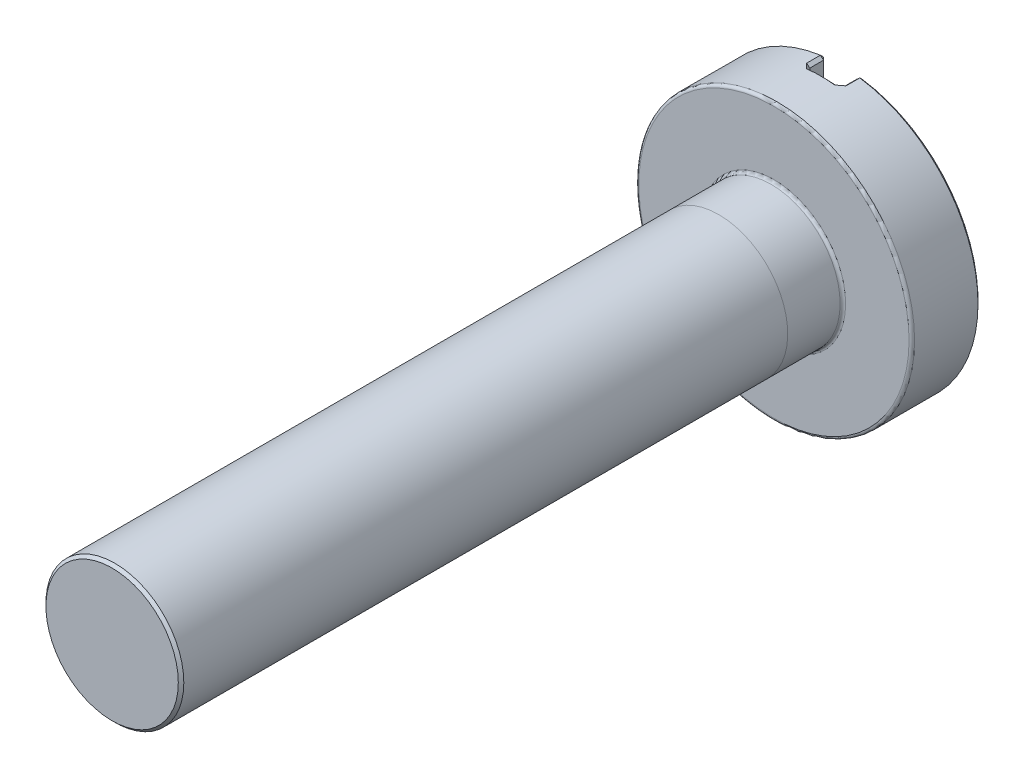
ISO-10303-21;
HEADER;
FILE_DESCRIPTION(('STEP AP214'),'2;1');
FILE_NAME('part.step','',(''),(''),'','','');
FILE_SCHEMA(('AUTOMOTIVE_DESIGN { 1 0 10303 214 1 1 1 1 }'));
ENDSEC;
DATA;
#1=APPLICATION_CONTEXT('core data for automotive mechanical design processes');
#2=APPLICATION_PROTOCOL_DEFINITION('international standard','automotive_design',2000,#1);
#3=PRODUCT_CONTEXT('',#1,'mechanical');
#4=PRODUCT('Part','Part','',(#3));
#5=PRODUCT_RELATED_PRODUCT_CATEGORY('part','',(#4));
#6=PRODUCT_DEFINITION_FORMATION('','',#4);
#7=PRODUCT_DEFINITION_CONTEXT('part definition',#1,'design');
#8=PRODUCT_DEFINITION('design','',#6,#7);
#9=PRODUCT_DEFINITION_SHAPE('','',#8);
#10=(LENGTH_UNIT() NAMED_UNIT(*) SI_UNIT(.MILLI.,.METRE.));
#11=(NAMED_UNIT(*) PLANE_ANGLE_UNIT() SI_UNIT($,.RADIAN.));
#12=(NAMED_UNIT(*) SI_UNIT($,.STERADIAN.) SOLID_ANGLE_UNIT());
#13=UNCERTAINTY_MEASURE_WITH_UNIT(LENGTH_MEASURE(1.E-05),#10,'distance_accuracy_value','');
#14=(GEOMETRIC_REPRESENTATION_CONTEXT(3) GLOBAL_UNCERTAINTY_ASSIGNED_CONTEXT((#13)) GLOBAL_UNIT_ASSIGNED_CONTEXT((#10,
#11,#12)) REPRESENTATION_CONTEXT('',''));
#15=CARTESIAN_POINT('',(0.,0.,0.));
#16=DIRECTION('',(0.,0.,1.));
#17=DIRECTION('',(1.,0.,0.));
#18=AXIS2_PLACEMENT_3D('',#15,#16,#17);
#19=CARTESIAN_POINT('',(0.,0.,12.));
#20=DIRECTION('',(0.,0.,-1.));
#21=DIRECTION('',(-1.,0.,0.));
#22=AXIS2_PLACEMENT_3D('',#19,#20,#21);
#23=CYLINDRICAL_SURFACE('',#22,1.25);
#24=CARTESIAN_POINT('',(0.,0.,11.95));
#25=DIRECTION('',(0.,0.,1.));
#26=DIRECTION('',(1.,0.,0.));
#27=AXIS2_PLACEMENT_3D('',#24,#25,#26);
#28=CIRCLE('',#27,1.25);
#29=CARTESIAN_POINT('',(1.25,0.,11.95));
#30=VERTEX_POINT('',#29);
#31=EDGE_CURVE('E46',#30,#30,#28,.F.);
#32=ORIENTED_EDGE('',*,*,#31,.T.);
#33=EDGE_LOOP('',(#32));
#34=FACE_BOUND('',#33,.T.);
#35=CARTESIAN_POINT('',(0.,0.,1.));
#36=DIRECTION('',(0.,0.,-1.));
#37=DIRECTION('',(0.,1.,0.));
#38=AXIS2_PLACEMENT_3D('',#35,#36,#37);
#39=CIRCLE('',#38,1.25);
#40=CARTESIAN_POINT('',(0.,1.25,1.));
#41=VERTEX_POINT('',#40);
#42=EDGE_CURVE('E11',#41,#41,#39,.T.);
#43=ORIENTED_EDGE('',*,*,#42,.F.);
#44=EDGE_LOOP('',(#43));
#45=FACE_BOUND('',#44,.T.);
#46=ADVANCED_FACE('F37',(#34,#45),#23,.T.);
#47=CARTESIAN_POINT('',(0.,0.,-1.25));
#48=DIRECTION('',(0.,0.,1.));
#49=DIRECTION('',(1.,0.,0.));
#50=AXIS2_PLACEMENT_3D('',#47,#48,#49);
#51=CYLINDRICAL_SURFACE('',#50,2.5);
#52=CARTESIAN_POINT('',(0.,0.,-0.0499999999999999));
#53=DIRECTION('',(0.,0.,1.));
#54=DIRECTION('',(1.,0.,0.));
#55=AXIS2_PLACEMENT_3D('',#52,#53,#54);
#56=CIRCLE('',#55,2.5);
#57=CARTESIAN_POINT('',(2.5,0.,-0.0499999999999999));
#58=VERTEX_POINT('',#57);
#59=EDGE_CURVE('E461',#58,#58,#56,.F.);
#60=ORIENTED_EDGE('',*,*,#59,.T.);
#61=EDGE_LOOP('',(#60));
#62=FACE_BOUND('',#61,.T.);
#63=CARTESIAN_POINT('',(-0.357142857142859,2.47435829652697,-0.950000000000001));
#64=CARTESIAN_POINT('',(-0.348283128722046,2.47563702333073,-0.941134122382786));
#65=CARTESIAN_POINT('',(-0.339398611806158,2.47687086598076,-0.932286484523354));
#66=CARTESIAN_POINT('',(-0.321576086205338,2.47924782192304,-0.914632993380492));
#67=CARTESIAN_POINT('',(-0.312638077482019,2.48039093515016,-0.905827140127055));
#68=CARTESIAN_POINT('',(-0.287577804069122,2.48345759248477,-0.881282240398704));
#69=CARTESIAN_POINT('',(-0.271391793277396,2.48527929599136,-0.865595509519482));
#70=CARTESIAN_POINT('',(-0.25510204081875,2.48695053203223,-0.850000000001686));
#71=B_SPLINE_CURVE_WITH_KNOTS('',3,(#63,#64,#65,#66,#67,#68,#69,#70),.UNSPECIFIED.,.F.,.F.,(4,2,
2,4),(0.,0.0377968117810584,0.0755936506896942,0.143431941871321),.UNSPECIFIED.);
#72=CARTESIAN_POINT('',(-0.357142857142859,2.47435829652697,-0.950000000000001));
#73=VERTEX_POINT('',#72);
#74=CARTESIAN_POINT('',(-0.255102040816325,2.48695053203142,-0.849999999999999));
#75=VERTEX_POINT('',#74);
#76=EDGE_CURVE('E250',#73,#75,#71,.T.);
#77=ORIENTED_EDGE('',*,*,#76,.F.);
#78=DIRECTION('',(0.,0.,1.));
#79=VECTOR('',#78,1.);
#80=CARTESIAN_POINT('',(-0.357142857142859,2.47435829652697,-1.25));
#81=LINE('',#80,#79);
#82=CARTESIAN_POINT('',(-0.357142857142859,2.47435829652697,-1.2));
#83=VERTEX_POINT('',#82);
#84=EDGE_CURVE('E248',#73,#83,#81,.F.);
#85=ORIENTED_EDGE('',*,*,#84,.T.);
#86=CARTESIAN_POINT('',(0.,0.,-1.2));
#87=DIRECTION('',(0.,0.,1.));
#88=DIRECTION('',(1.,0.,0.));
#89=AXIS2_PLACEMENT_3D('',#86,#87,#88);
#90=CIRCLE('',#89,2.5);
#91=CARTESIAN_POINT('',(-0.357142857142859,-2.47435829652697,-1.2));
#92=VERTEX_POINT('',#91);
#93=EDGE_CURVE('E243',#83,#92,#90,.T.);
#94=ORIENTED_EDGE('',*,*,#93,.T.);
#95=DIRECTION('',(0.,0.,1.));
#96=VECTOR('',#95,1.);
#97=CARTESIAN_POINT('',(-0.357142857142859,-2.47435829652697,-1.25));
#98=LINE('',#97,#96);
#99=CARTESIAN_POINT('',(-0.357142857142859,-2.47435829652697,-0.950000000000001));
#100=VERTEX_POINT('',#99);
#101=EDGE_CURVE('E241',#92,#100,#98,.T.);
#102=ORIENTED_EDGE('',*,*,#101,.T.);
#103=CARTESIAN_POINT('',(-0.255102040816326,-2.48695053203142,-0.849999999999999));
#104=CARTESIAN_POINT('',(-0.264178191386565,-2.48601946587719,-0.858688711502498));
#105=CARTESIAN_POINT('',(-0.273221965792444,-2.48504163410855,-0.86740607020343));
#106=CARTESIAN_POINT('',(-0.291248879878858,-2.4829934567889,-0.884892451642306));
#107=CARTESIAN_POINT('',(-0.300232019629449,-2.4819231113448,-0.893661474320537));
#108=CARTESIAN_POINT('',(-0.325259245581335,-2.47880383809922,-0.918233587454575));
#109=CARTESIAN_POINT('',(-0.341240583045981,-2.47665328543806,-0.934087828582101));
#110=CARTESIAN_POINT('',(-0.357142857142859,-2.47435829652697,-0.950000000000001));
#111=B_SPLINE_CURVE_WITH_KNOTS('',3,(#103,#104,#105,#106,#107,#108,#109,#110),.UNSPECIFIED.,.F.,
.F.,(4,2,2,4),(0.,0.0377969208692553,0.0755937980612077,0.143432033029298),.UNSPECIFIED.);
#112=CARTESIAN_POINT('',(-0.255102040816326,-2.48695053203142,-0.849999999999999));
#113=VERTEX_POINT('',#112);
#114=EDGE_CURVE('E234',#113,#100,#111,.T.);
#115=ORIENTED_EDGE('',*,*,#114,.F.);
#116=CARTESIAN_POINT('',(0.,0.,-0.849999999999999));
#117=DIRECTION('',(0.,0.,-1.));
#118=DIRECTION('',(-1.,0.,0.));
#119=AXIS2_PLACEMENT_3D('',#116,#117,#118);
#120=CIRCLE('',#119,2.5);
#121=CARTESIAN_POINT('',(0.255102040816324,-2.48695053203142,-0.849999999999999));
#122=VERTEX_POINT('',#121);
#123=EDGE_CURVE('E197',#113,#122,#120,.F.);
#124=ORIENTED_EDGE('',*,*,#123,.T.);
#125=CARTESIAN_POINT('',(0.357142857142858,-2.47435829652697,-0.950000000000001));
#126=CARTESIAN_POINT('',(0.348283128722045,-2.47563702333072,-0.941134122382786));
#127=CARTESIAN_POINT('',(0.339398611806156,-2.47687086598076,-0.932286484523354));
#128=CARTESIAN_POINT('',(0.321576086205337,-2.47924782192304,-0.914632993380492));
#129=CARTESIAN_POINT('',(0.312638077482018,-2.48039093515016,-0.905827140127055));
#130=CARTESIAN_POINT('',(0.287577804069122,-2.48345759248477,-0.881282240398703));
#131=CARTESIAN_POINT('',(0.271391793277396,-2.48527929599137,-0.865595509519482));
#132=CARTESIAN_POINT('',(0.255102040818749,-2.48695053203224,-0.850000000001686));
#133=B_SPLINE_CURVE_WITH_KNOTS('',3,(#125,#126,#127,#128,#129,#130,#131,#132),.UNSPECIFIED.,.F.,
.F.,(4,2,2,4),(0.,0.0377968117810586,0.0755936506896945,0.143431941871321),.UNSPECIFIED.);
#134=CARTESIAN_POINT('',(0.357142857142858,-2.47435829652697,-0.950000000000001));
#135=VERTEX_POINT('',#134);
#136=EDGE_CURVE('E188',#135,#122,#133,.T.);
#137=ORIENTED_EDGE('',*,*,#136,.F.);
#138=DIRECTION('',(0.,0.,1.));
#139=VECTOR('',#138,1.);
#140=CARTESIAN_POINT('',(0.357142857142858,-2.47435829652697,-1.25));
#141=LINE('',#140,#139);
#142=CARTESIAN_POINT('',(0.357142857142858,-2.47435829652697,-1.2));
#143=VERTEX_POINT('',#142);
#144=EDGE_CURVE('E186',#135,#143,#141,.F.);
#145=ORIENTED_EDGE('',*,*,#144,.T.);
#146=CARTESIAN_POINT('',(0.,0.,-1.2));
#147=DIRECTION('',(0.,0.,1.));
#148=DIRECTION('',(1.,0.,0.));
#149=AXIS2_PLACEMENT_3D('',#146,#147,#148);
#150=CIRCLE('',#149,2.5);
#151=CARTESIAN_POINT('',(0.357142857142859,2.47435829652697,-1.2));
#152=VERTEX_POINT('',#151);
#153=EDGE_CURVE('E182',#143,#152,#150,.T.);
#154=ORIENTED_EDGE('',*,*,#153,.T.);
#155=DIRECTION('',(0.,0.,1.));
#156=VECTOR('',#155,1.);
#157=CARTESIAN_POINT('',(0.357142857142859,2.47435829652697,-1.25));
#158=LINE('',#157,#156);
#159=CARTESIAN_POINT('',(0.357142857142859,2.47435829652697,-0.950000000000001));
#160=VERTEX_POINT('',#159);
#161=EDGE_CURVE('E184',#152,#160,#158,.T.);
#162=ORIENTED_EDGE('',*,*,#161,.T.);
#163=CARTESIAN_POINT('',(0.255102040816325,2.48695053203142,-0.849999999999999));
#164=CARTESIAN_POINT('',(0.264178191386564,2.48601946587719,-0.858688711502498));
#165=CARTESIAN_POINT('',(0.273221965792444,2.48504163410855,-0.86740607020343));
#166=CARTESIAN_POINT('',(0.291248879878858,2.4829934567889,-0.884892451642306));
#167=CARTESIAN_POINT('',(0.300232019629448,2.4819231113448,-0.893661474320537));
#168=CARTESIAN_POINT('',(0.325259245581334,2.47880383809922,-0.918233587454575));
#169=CARTESIAN_POINT('',(0.34124058304598,2.47665328543805,-0.934087828582101));
#170=CARTESIAN_POINT('',(0.357142857142859,2.47435829652697,-0.950000000000001));
#171=B_SPLINE_CURVE_WITH_KNOTS('',3,(#163,#164,#165,#166,#167,#168,#169,#170),.UNSPECIFIED.,.F.,
.F.,(4,2,2,4),(0.,0.0377969208692553,0.0755937980612078,0.143432033029298),.UNSPECIFIED.);
#172=CARTESIAN_POINT('',(0.255102040816325,2.48695053203142,-0.849999999999999));
#173=VERTEX_POINT('',#172);
#174=EDGE_CURVE('E227',#173,#160,#171,.T.);
#175=ORIENTED_EDGE('',*,*,#174,.F.);
#176=CARTESIAN_POINT('',(0.,0.,-0.849999999999999));
#177=DIRECTION('',(0.,0.,-1.));
#178=DIRECTION('',(-1.,0.,0.));
#179=AXIS2_PLACEMENT_3D('',#176,#177,#178);
#180=CIRCLE('',#179,2.5);
#181=EDGE_CURVE('E246',#173,#75,#180,.F.);
#182=ORIENTED_EDGE('',*,*,#181,.T.);
#183=EDGE_LOOP('',(#77,#85,#94,#102,#115,#124,#137,#145,#154,#162,#175,#182));
#184=FACE_BOUND('',#183,.T.);
#185=ADVANCED_FACE('F199',(#62,#184),#51,.T.);
#186=CARTESIAN_POINT('',(0.,0.,-1.25));
#187=DIRECTION('',(0.,0.,1.));
#188=DIRECTION('',(1.,0.,0.));
#189=AXIS2_PLACEMENT_3D('',#186,#187,#188);
#190=PLANE('',#189);
#191=CARTESIAN_POINT('',(0.,0.,-1.25));
#192=DIRECTION('',(0.,0.,1.));
#193=DIRECTION('',(1.,0.,0.));
#194=AXIS2_PLACEMENT_3D('',#191,#192,#193);
#195=CIRCLE('',#194,2.45);
#196=CARTESIAN_POINT('',(-0.350000000000002,-2.42487113059643,-1.25));
#197=VERTEX_POINT('',#196);
#198=CARTESIAN_POINT('',(-0.350000000000001,2.42487113059643,-1.25));
#199=VERTEX_POINT('',#198);
#200=EDGE_CURVE('E165',#197,#199,#195,.F.);
#201=ORIENTED_EDGE('',*,*,#200,.T.);
#202=DIRECTION('',(0.,-1.,0.));
#203=VECTOR('',#202,1.);
#204=CARTESIAN_POINT('',(-0.350000000000001,0.,-1.25));
#205=LINE('',#204,#203);
#206=EDGE_CURVE('E147',#199,#197,#205,.T.);
#207=ORIENTED_EDGE('',*,*,#206,.T.);
#208=EDGE_LOOP('',(#201,#207));
#209=FACE_BOUND('',#208,.T.);
#210=ADVANCED_FACE('F172',(#209),#190,.F.);
#211=ORIENTED_EDGE('',*,*,#42,.T.);
#212=EDGE_LOOP('',(#211));
#213=FACE_BOUND('',#212,.T.);
#214=CARTESIAN_POINT('',(0.,0.,0.0499999999999997));
#215=DIRECTION('',(0.,0.,1.));
#216=DIRECTION('',(1.,0.,0.));
#217=AXIS2_PLACEMENT_3D('',#214,#215,#216);
#218=CIRCLE('',#217,1.25);
#219=CARTESIAN_POINT('',(1.25,0.,0.0499999999999997));
#220=VERTEX_POINT('',#219);
#221=EDGE_CURVE('E459',#220,#220,#218,.T.);
#222=ORIENTED_EDGE('',*,*,#221,.T.);
#223=EDGE_LOOP('',(#222));
#224=FACE_BOUND('',#223,.T.);
#225=ADVANCED_FACE('F208',(#213,#224),#23,.T.);
#226=CARTESIAN_POINT('',(0.,0.,12.));
#227=DIRECTION('',(0.,0.,1.));
#228=DIRECTION('',(1.,0.,0.));
#229=AXIS2_PLACEMENT_3D('',#226,#227,#228);
#230=PLANE('',#229);
#231=CARTESIAN_POINT('',(0.,0.,12.));
#232=DIRECTION('',(0.,0.,1.));
#233=DIRECTION('',(1.,0.,0.));
#234=AXIS2_PLACEMENT_3D('',#231,#232,#233);
#235=CIRCLE('',#234,1.19999999999999);
#236=CARTESIAN_POINT('',(1.19999999999999,0.,12.));
#237=VERTEX_POINT('',#236);
#238=EDGE_CURVE('E460',#237,#237,#235,.T.);
#239=ORIENTED_EDGE('',*,*,#238,.T.);
#240=EDGE_LOOP('',(#239));
#241=FACE_BOUND('',#240,.T.);
#242=ADVANCED_FACE('F446',(#241),#230,.T.);
#243=CARTESIAN_POINT('',(0.,0.,-1.25));
#244=DIRECTION('',(0.,0.,1.));
#245=DIRECTION('',(1.,0.,0.));
#246=AXIS2_PLACEMENT_3D('',#243,#244,#245);
#247=CIRCLE('',#246,2.45);
#248=CARTESIAN_POINT('',(0.350000000000001,2.42487113059643,-1.25));
#249=VERTEX_POINT('',#248);
#250=CARTESIAN_POINT('',(0.35,-2.42487113059643,-1.25));
#251=VERTEX_POINT('',#250);
#252=EDGE_CURVE('E52',#249,#251,#247,.F.);
#253=ORIENTED_EDGE('',*,*,#252,.T.);
#254=DIRECTION('',(0.,1.,0.));
#255=VECTOR('',#254,1.);
#256=CARTESIAN_POINT('',(0.35,0.,-1.25));
#257=LINE('',#256,#255);
#258=EDGE_CURVE('E477',#251,#249,#257,.T.);
#259=ORIENTED_EDGE('',*,*,#258,.T.);
#260=EDGE_LOOP('',(#253,#259));
#261=FACE_BOUND('',#260,.T.);
#262=ADVANCED_FACE('F452',(#261),#190,.F.);
#263=CARTESIAN_POINT('',(0.,0.,0.));
#264=DIRECTION('',(0.,0.,1.));
#265=DIRECTION('',(1.,0.,0.));
#266=AXIS2_PLACEMENT_3D('',#263,#264,#265);
#267=PLANE('',#266);
#268=CARTESIAN_POINT('',(0.,0.,0.));
#269=DIRECTION('',(0.,0.,1.));
#270=DIRECTION('',(1.,0.,0.));
#271=AXIS2_PLACEMENT_3D('',#268,#269,#270);
#272=CIRCLE('',#271,2.45);
#273=CARTESIAN_POINT('',(2.45,0.,0.));
#274=VERTEX_POINT('',#273);
#275=EDGE_CURVE('E466',#274,#274,#272,.T.);
#276=ORIENTED_EDGE('',*,*,#275,.T.);
#277=EDGE_LOOP('',(#276));
#278=FACE_BOUND('',#277,.T.);
#279=CARTESIAN_POINT('',(0.,0.,0.));
#280=DIRECTION('',(0.,0.,1.));
#281=DIRECTION('',(1.,0.,0.));
#282=AXIS2_PLACEMENT_3D('',#279,#280,#281);
#283=CIRCLE('',#282,1.3);
#284=CARTESIAN_POINT('',(1.3,0.,0.));
#285=VERTEX_POINT('',#284);
#286=EDGE_CURVE('E474',#285,#285,#283,.F.);
#287=ORIENTED_EDGE('',*,*,#286,.T.);
#288=EDGE_LOOP('',(#287));
#289=FACE_BOUND('',#288,.T.);
#290=ADVANCED_FACE('F604',(#278,#289),#267,.T.);
#291=CARTESIAN_POINT('',(-0.299999999999999,11.0409396780184,-0.9));
#292=DIRECTION('',(-1.,0.,0.));
#293=DIRECTION('',(0.,-1.,0.));
#294=AXIS2_PLACEMENT_3D('',#291,#292,#293);
#295=PLANE('',#294);
#296=DIRECTION('',(0.,0.,-1.));
#297=VECTOR('',#296,1.);
#298=CARTESIAN_POINT('',(-0.300000000000001,-2.42487113059643,-1.25));
#299=LINE('',#298,#297);
#300=CARTESIAN_POINT('',(-0.300000000000001,-2.42487113059643,-0.950000000000001));
#301=VERTEX_POINT('',#300);
#302=CARTESIAN_POINT('',(-0.300000000000001,-2.42487113059643,-1.2));
#303=VERTEX_POINT('',#302);
#304=EDGE_CURVE('E179',#301,#303,#299,.T.);
#305=ORIENTED_EDGE('',*,*,#304,.T.);
#306=DIRECTION('',(0.,1.,0.));
#307=VECTOR('',#306,1.);
#308=CARTESIAN_POINT('',(-0.299999999999999,11.0409396780184,-1.2));
#309=LINE('',#308,#307);
#310=CARTESIAN_POINT('',(-0.3,2.42487113059643,-1.2));
#311=VERTEX_POINT('',#310);
#312=EDGE_CURVE('E149',#303,#311,#309,.T.);
#313=ORIENTED_EDGE('',*,*,#312,.T.);
#314=DIRECTION('',(0.,0.,1.));
#315=VECTOR('',#314,1.);
#316=CARTESIAN_POINT('',(-0.3,2.42487113059643,-0.9));
#317=LINE('',#316,#315);
#318=CARTESIAN_POINT('',(-0.3,2.42487113059643,-0.950000000000001));
#319=VERTEX_POINT('',#318);
#320=EDGE_CURVE('E175',#311,#319,#317,.T.);
#321=ORIENTED_EDGE('',*,*,#320,.T.);
#322=DIRECTION('',(0.,-1.,0.));
#323=VECTOR('',#322,1.);
#324=CARTESIAN_POINT('',(-0.299999999999999,11.0409396780184,-0.950000000000001));
#325=LINE('',#324,#323);
#326=EDGE_CURVE('E173',#319,#301,#325,.T.);
#327=ORIENTED_EDGE('',*,*,#326,.T.);
#328=EDGE_LOOP('',(#305,#313,#321,#327));
#329=FACE_BOUND('',#328,.T.);
#330=ADVANCED_FACE('F560',(#329),#295,.F.);
#331=CARTESIAN_POINT('',(0.300000000000001,11.0409396780184,-0.9));
#332=DIRECTION('',(1.,0.,0.));
#333=DIRECTION('',(0.,1.,0.));
#334=AXIS2_PLACEMENT_3D('',#331,#332,#333);
#335=PLANE('',#334);
#336=DIRECTION('',(0.,0.,1.));
#337=VECTOR('',#336,1.);
#338=CARTESIAN_POINT('',(0.299999999999999,-2.42487113059643,-0.9));
#339=LINE('',#338,#337);
#340=CARTESIAN_POINT('',(0.299999999999999,-2.42487113059643,-1.2));
#341=VERTEX_POINT('',#340);
#342=CARTESIAN_POINT('',(0.299999999999999,-2.42487113059643,-0.950000000000001));
#343=VERTEX_POINT('',#342);
#344=EDGE_CURVE('E496',#341,#343,#339,.T.);
#345=ORIENTED_EDGE('',*,*,#344,.T.);
#346=DIRECTION('',(0.,1.,0.));
#347=VECTOR('',#346,1.);
#348=CARTESIAN_POINT('',(0.300000000000001,11.0409396780184,-0.950000000000001));
#349=LINE('',#348,#347);
#350=CARTESIAN_POINT('',(0.3,2.42487113059643,-0.950000000000001));
#351=VERTEX_POINT('',#350);
#352=EDGE_CURVE('E525',#343,#351,#349,.T.);
#353=ORIENTED_EDGE('',*,*,#352,.T.);
#354=DIRECTION('',(0.,0.,-1.));
#355=VECTOR('',#354,1.);
#356=CARTESIAN_POINT('',(0.3,2.42487113059643,-1.25));
#357=LINE('',#356,#355);
#358=CARTESIAN_POINT('',(0.3,2.42487113059643,-1.2));
#359=VERTEX_POINT('',#358);
#360=EDGE_CURVE('E520',#351,#359,#357,.T.);
#361=ORIENTED_EDGE('',*,*,#360,.T.);
#362=DIRECTION('',(0.,-1.,0.));
#363=VECTOR('',#362,1.);
#364=CARTESIAN_POINT('',(0.300000000000001,11.0409396780184,-1.2));
#365=LINE('',#364,#363);
#366=EDGE_CURVE('E257',#359,#341,#365,.T.);
#367=ORIENTED_EDGE('',*,*,#366,.T.);
#368=EDGE_LOOP('',(#345,#353,#361,#367));
#369=FACE_BOUND('',#368,.T.);
#370=ADVANCED_FACE('F660',(#369),#335,.F.);
#371=CARTESIAN_POINT('',(0.,0.,-0.9));
#372=DIRECTION('',(0.,0.,-1.));
#373=DIRECTION('',(-1.,0.,0.));
#374=AXIS2_PLACEMENT_3D('',#371,#372,#373);
#375=PLANE('',#374);
#376=DIRECTION('',(0.,-1.,0.));
#377=VECTOR('',#376,1.);
#378=CARTESIAN_POINT('',(0.249999999999998,0.,-0.9));
#379=LINE('',#378,#377);
#380=CARTESIAN_POINT('',(0.249999999999998,2.43721152139079,-0.9));
#381=VERTEX_POINT('',#380);
#382=CARTESIAN_POINT('',(0.249999999999998,-2.43721152139079,-0.9));
#383=VERTEX_POINT('',#382);
#384=EDGE_CURVE('E526',#381,#383,#379,.T.);
#385=ORIENTED_EDGE('',*,*,#384,.T.);
#386=CARTESIAN_POINT('',(0.,0.,-0.9));
#387=DIRECTION('',(0.,0.,-1.));
#388=DIRECTION('',(-1.,0.,0.));
#389=AXIS2_PLACEMENT_3D('',#386,#387,#388);
#390=CIRCLE('',#389,2.45);
#391=CARTESIAN_POINT('',(-0.249999999999999,-2.43721152139079,-0.9));
#392=VERTEX_POINT('',#391);
#393=EDGE_CURVE('E511',#383,#392,#390,.T.);
#394=ORIENTED_EDGE('',*,*,#393,.T.);
#395=DIRECTION('',(0.,1.,0.));
#396=VECTOR('',#395,1.);
#397=CARTESIAN_POINT('',(-0.249999999999999,0.,-0.9));
#398=LINE('',#397,#396);
#399=CARTESIAN_POINT('',(-0.249999999999999,2.43721152139079,-0.9));
#400=VERTEX_POINT('',#399);
#401=EDGE_CURVE('E531',#392,#400,#398,.T.);
#402=ORIENTED_EDGE('',*,*,#401,.T.);
#403=CARTESIAN_POINT('',(0.,0.,-0.9));
#404=DIRECTION('',(0.,0.,-1.));
#405=DIRECTION('',(-1.,0.,0.));
#406=AXIS2_PLACEMENT_3D('',#403,#404,#405);
#407=CIRCLE('',#406,2.45);
#408=EDGE_CURVE('E528',#400,#381,#407,.T.);
#409=ORIENTED_EDGE('',*,*,#408,.T.);
#410=EDGE_LOOP('',(#385,#394,#402,#409));
#411=FACE_BOUND('',#410,.T.);
#412=ADVANCED_FACE('F424',(#411),#375,.T.);
#413=CARTESIAN_POINT('',(0.,0.,-1.2));
#414=DIRECTION('',(0.,0.,1.));
#415=DIRECTION('',(1.,0.,0.));
#416=AXIS2_PLACEMENT_3D('',#413,#414,#415);
#417=CONICAL_SURFACE('',#416,2.5,0.785398163397461);
#418=DIRECTION('',(0.101015254455233,-0.699854212223773,0.707106781186538));
#419=VECTOR('',#418,1.);
#420=CARTESIAN_POINT('',(0.,0.,-3.69999999999995));
#421=LINE('',#420,#419);
#422=EDGE_CURVE('E480',#251,#143,#421,.T.);
#423=ORIENTED_EDGE('',*,*,#422,.F.);
#424=ORIENTED_EDGE('',*,*,#252,.F.);
#425=DIRECTION('',(-0.101015254455233,-0.699854212223773,-0.707106781186538));
#426=VECTOR('',#425,1.);
#427=CARTESIAN_POINT('',(0.,0.,-3.69999999999995));
#428=LINE('',#427,#426);
#429=EDGE_CURVE('E60',#152,#249,#428,.T.);
#430=ORIENTED_EDGE('',*,*,#429,.F.);
#431=ORIENTED_EDGE('',*,*,#153,.F.);
#432=EDGE_LOOP('',(#423,#424,#430,#431));
#433=FACE_BOUND('',#432,.T.);
#434=ADVANCED_FACE('F420',(#433),#417,.T.);
#435=CARTESIAN_POINT('',(0.35,0.,-1.25));
#436=DIRECTION('',(0.707106781186538,0.,0.707106781186557));
#437=DIRECTION('',(0.,1.,0.));
#438=AXIS2_PLACEMENT_3D('',#435,#436,#437);
#439=PLANE('',#438);
#440=DIRECTION('',(0.707106781186557,0.,-0.707106781186538));
#441=VECTOR('',#440,1.);
#442=CARTESIAN_POINT('',(0.3,2.42487113059643,-1.2));
#443=LINE('',#442,#441);
#444=EDGE_CURVE('E170',#249,#359,#443,.F.);
#445=ORIENTED_EDGE('',*,*,#444,.F.);
#446=ORIENTED_EDGE('',*,*,#258,.F.);
#447=DIRECTION('',(-0.707106781186557,0.,0.707106781186538));
#448=VECTOR('',#447,1.);
#449=CARTESIAN_POINT('',(0.32857142857143,-2.42487113059643,-1.22857142857143));
#450=LINE('',#449,#448);
#451=EDGE_CURVE('E483',#341,#251,#450,.F.);
#452=ORIENTED_EDGE('',*,*,#451,.F.);
#453=ORIENTED_EDGE('',*,*,#366,.F.);
#454=EDGE_LOOP('',(#445,#446,#452,#453));
#455=FACE_BOUND('',#454,.T.);
#456=ADVANCED_FACE('F417',(#455),#439,.F.);
#457=CARTESIAN_POINT('',(0.3,2.42487113059643,-1.2));
#458=DIRECTION('',(-0.547722557505162,0.632455532033675,-0.547722557505171));
#459=DIRECTION('',(0.,0.654653670707981,0.755928946018451));
#460=AXIS2_PLACEMENT_3D('',#457,#458,#459);
#461=PLANE('',#460);
#462=ORIENTED_EDGE('',*,*,#429,.T.);
#463=ORIENTED_EDGE('',*,*,#444,.T.);
#464=DIRECTION('',(0.755928946018456,0.654653670707975,0.));
#465=VECTOR('',#464,1.);
#466=CARTESIAN_POINT('',(0.3,2.42487113059643,-1.2));
#467=LINE('',#466,#465);
#468=EDGE_CURVE('E485',#152,#359,#467,.F.);
#469=ORIENTED_EDGE('',*,*,#468,.F.);
#470=EDGE_LOOP('',(#462,#463,#469));
#471=FACE_BOUND('',#470,.T.);
#472=ADVANCED_FACE('F413',(#471),#461,.T.);
#473=CARTESIAN_POINT('',(0.357142857142858,-2.47435829652697,-1.2));
#474=DIRECTION('',(-0.547722557505166,-0.632455532033674,-0.547722557505169));
#475=DIRECTION('',(0.,0.65465367070798,-0.755928946018452));
#476=AXIS2_PLACEMENT_3D('',#473,#474,#475);
#477=PLANE('',#476);
#478=ORIENTED_EDGE('',*,*,#451,.T.);
#479=ORIENTED_EDGE('',*,*,#422,.T.);
#480=DIRECTION('',(0.755928946018453,-0.654653670707979,0.));
#481=VECTOR('',#480,1.);
#482=CARTESIAN_POINT('',(0.357142857142858,-2.47435829652697,-1.2));
#483=LINE('',#482,#481);
#484=EDGE_CURVE('E379',#341,#143,#483,.T.);
#485=ORIENTED_EDGE('',*,*,#484,.F.);
#486=EDGE_LOOP('',(#478,#479,#485));
#487=FACE_BOUND('',#486,.T.);
#488=ADVANCED_FACE('F409',(#487),#477,.T.);
#489=CARTESIAN_POINT('',(0.3,2.42487113059643,-1.25));
#490=DIRECTION('',(-0.654653670707975,0.755928946018456,0.));
#491=DIRECTION('',(0.,0.,1.));
#492=AXIS2_PLACEMENT_3D('',#489,#490,#491);
#493=PLANE('',#492);
#494=ORIENTED_EDGE('',*,*,#468,.T.);
#495=ORIENTED_EDGE('',*,*,#360,.F.);
#496=DIRECTION('',(-0.755928946018456,-0.654653670707975,0.));
#497=VECTOR('',#496,1.);
#498=CARTESIAN_POINT('',(0.357142857142859,2.47435829652697,-0.950000000000001));
#499=LINE('',#498,#497);
#500=EDGE_CURVE('E380',#160,#351,#499,.T.);
#501=ORIENTED_EDGE('',*,*,#500,.F.);
#502=ORIENTED_EDGE('',*,*,#161,.F.);
#503=EDGE_LOOP('',(#494,#495,#501,#502));
#504=FACE_BOUND('',#503,.T.);
#505=ADVANCED_FACE('F405',(#504),#493,.T.);
#506=CARTESIAN_POINT('',(0.299999999999999,-2.42487113059643,-1.25));
#507=DIRECTION('',(0.654653670707979,0.755928946018453,0.));
#508=DIRECTION('',(0.,0.,1.));
#509=AXIS2_PLACEMENT_3D('',#506,#507,#508);
#510=PLANE('',#509);
#511=ORIENTED_EDGE('',*,*,#484,.T.);
#512=ORIENTED_EDGE('',*,*,#144,.F.);
#513=DIRECTION('',(0.755928946018453,-0.654653670707978,0.));
#514=VECTOR('',#513,1.);
#515=CARTESIAN_POINT('',(0.299999999999999,-2.42487113059643,-0.950000000000001));
#516=LINE('',#515,#514);
#517=EDGE_CURVE('E507',#343,#135,#516,.T.);
#518=ORIENTED_EDGE('',*,*,#517,.F.);
#519=ORIENTED_EDGE('',*,*,#344,.F.);
#520=EDGE_LOOP('',(#511,#512,#518,#519));
#521=FACE_BOUND('',#520,.T.);
#522=ADVANCED_FACE('F355',(#521),#510,.F.);
#523=CARTESIAN_POINT('',(0.249999999999998,0.,-0.9));
#524=DIRECTION('',(0.707106781186548,0.,0.707106781186548));
#525=DIRECTION('',(0.,-1.,0.));
#526=AXIS2_PLACEMENT_3D('',#523,#524,#525);
#527=PLANE('',#526);
#528=CARTESIAN_POINT('',(0.3,2.42487113059643,-0.950000000000001));
#529=CARTESIAN_POINT('',(0.29561196801493,2.42595413118671,-0.945611968014931));
#530=CARTESIAN_POINT('',(0.291223936029859,2.42703713177698,-0.941223936029861));
#531=CARTESIAN_POINT('',(0.282447872059719,2.42920313295754,-0.932447872059721));
#532=CARTESIAN_POINT('',(0.278059840074649,2.43028613354782,-0.92805984007465));
#533=CARTESIAN_POINT('',(0.265781205393052,2.43331659655566,-0.915781205393053));
#534=CARTESIAN_POINT('',(0.257890602696525,2.43526405897322,-0.907890602696527));
#535=CARTESIAN_POINT('',(0.249999999999998,2.43721152139079,-0.9));
#536=B_SPLINE_CURVE_WITH_KNOTS('',3,(#528,#529,#530,#531,#532,#533,#534,#535),.UNSPECIFIED.,.F.,
.F.,(4,2,2,4),(0.,0.0188982236504619,0.0377964473009237,0.071779420762206),.UNSPECIFIED.);
#537=EDGE_CURVE('E370',#351,#381,#536,.T.);
#538=ORIENTED_EDGE('',*,*,#537,.F.);
#539=ORIENTED_EDGE('',*,*,#352,.F.);
#540=CARTESIAN_POINT('',(0.249999999999998,-2.43721152139079,-0.9));
#541=CARTESIAN_POINT('',(0.254388031985068,-2.43612852080051,-0.90438803198507));
#542=CARTESIAN_POINT('',(0.258776063970138,-2.43504552021023,-0.90877606397014));
#543=CARTESIAN_POINT('',(0.267552127940279,-2.43287951902967,-0.917552127940281));
#544=CARTESIAN_POINT('',(0.271940159925349,-2.4317965184394,-0.921940159925351));
#545=CARTESIAN_POINT('',(0.284218794606946,-2.42876605543155,-0.934218794606948));
#546=CARTESIAN_POINT('',(0.292109397303473,-2.42681859301399,-0.942109397303475));
#547=CARTESIAN_POINT('',(0.299999999999999,-2.42487113059643,-0.950000000000001));
#548=B_SPLINE_CURVE_WITH_KNOTS('',3,(#540,#541,#542,#543,#544,#545,#546,#547),.UNSPECIFIED.,.F.,
.F.,(4,2,2,4),(0.,0.0188982236504619,0.0377964473009237,0.0717794207622062),.UNSPECIFIED.);
#549=EDGE_CURVE('E363',#383,#343,#548,.T.);
#550=ORIENTED_EDGE('',*,*,#549,.F.);
#551=ORIENTED_EDGE('',*,*,#384,.F.);
#552=EDGE_LOOP('',(#538,#539,#550,#551));
#553=FACE_BOUND('',#552,.T.);
#554=ADVANCED_FACE('F350',(#553),#527,.F.);
#555=CARTESIAN_POINT('',(0.249999999999998,2.43721152139079,-0.9));
#556=CARTESIAN_POINT('',(0.3,2.42487113059643,-0.950000000000001));
#557=CARTESIAN_POINT('',(0.255102040816325,2.48695053203142,-0.849999999999999));
#558=CARTESIAN_POINT('',(0.357142857142859,2.47435829652697,-0.950000000000001));
#559=CARTESIAN_POINT('',(0.255185023576885,2.48775951819188,-0.849186768946505));
#560=CARTESIAN_POINT('',(0.358072264061137,2.47516318652865,-0.950000000000001));
#561=B_SPLINE_SURFACE_WITH_KNOTS('',1,1,((#555,#556),(#557,#558),(#559,#560)),.UNSPECIFIED.,.F.,
.F.,.F.,(2,1,2),(2,2),(0.,1.,1.01626462106986),(0.,1.),.UNSPECIFIED.);
#562=DIRECTION('',(0.0721537531822999,0.703415834269961,0.70710678118655));
#563=VECTOR('',#562,1.);
#564=CARTESIAN_POINT('',(0.249999999999998,2.43721152139079,-0.9));
#565=LINE('',#564,#563);
#566=EDGE_CURVE('E512',#173,#381,#565,.F.);
#567=ORIENTED_EDGE('',*,*,#500,.T.);
#568=ORIENTED_EDGE('',*,*,#537,.T.);
#569=ORIENTED_EDGE('',*,*,#566,.F.);
#570=ORIENTED_EDGE('',*,*,#174,.T.);
#571=EDGE_LOOP('',(#567,#568,#569,#570));
#572=FACE_BOUND('',#571,.T.);
#573=ADVANCED_FACE('F354',(#572),#561,.T.);
#574=CARTESIAN_POINT('',(0.299999999999999,-2.42487113059643,-0.950000000000001));
#575=CARTESIAN_POINT('',(0.249999999999998,-2.43721152139079,-0.9));
#576=CARTESIAN_POINT('',(0.357142857142858,-2.47435829652697,-0.950000000000001));
#577=CARTESIAN_POINT('',(0.255102040816324,-2.48695053203142,-0.849999999999999));
#578=CARTESIAN_POINT('',(0.358063042571902,-2.47515520048471,-0.950000000000001));
#579=CARTESIAN_POINT('',(0.255184200229632,-2.48775149150623,-0.849194837749585));
#580=B_SPLINE_SURFACE_WITH_KNOTS('',1,1,((#574,#575),(#576,#577),(#578,#579)),.UNSPECIFIED.,.F.,
.F.,.F.,(2,1,2),(2,2),(0.,1.,1.01610324500827),(0.,1.),.UNSPECIFIED.);
#581=DIRECTION('',(-0.0721537531822999,0.703415834269961,-0.70710678118655));
#582=VECTOR('',#581,1.);
#583=CARTESIAN_POINT('',(0.255102040816324,-2.48695053203142,-0.849999999999999));
#584=LINE('',#583,#582);
#585=EDGE_CURVE('E318',#383,#122,#584,.F.);
#586=ORIENTED_EDGE('',*,*,#517,.T.);
#587=ORIENTED_EDGE('',*,*,#136,.T.);
#588=ORIENTED_EDGE('',*,*,#585,.F.);
#589=ORIENTED_EDGE('',*,*,#549,.T.);
#590=EDGE_LOOP('',(#586,#587,#588,#589));
#591=FACE_BOUND('',#590,.T.);
#592=ADVANCED_FACE('F348',(#591),#580,.T.);
#593=CARTESIAN_POINT('',(0.,0.,-0.849999999999999));
#594=DIRECTION('',(0.,0.,1.));
#595=DIRECTION('',(1.,0.,0.));
#596=AXIS2_PLACEMENT_3D('',#593,#594,#595);
#597=CONICAL_SURFACE('',#596,2.5,0.785398163397448);
#598=ORIENTED_EDGE('',*,*,#566,.T.);
#599=ORIENTED_EDGE('',*,*,#408,.F.);
#600=DIRECTION('',(0.0721537531822999,-0.703415834269961,-0.70710678118655));
#601=VECTOR('',#600,1.);
#602=CARTESIAN_POINT('',(-0.255102040816325,2.48695053203142,-0.849999999999999));
#603=LINE('',#602,#601);
#604=EDGE_CURVE('E319',#75,#400,#603,.T.);
#605=ORIENTED_EDGE('',*,*,#604,.F.);
#606=ORIENTED_EDGE('',*,*,#181,.F.);
#607=EDGE_LOOP('',(#598,#599,#605,#606));
#608=FACE_BOUND('',#607,.T.);
#609=ADVANCED_FACE('F344',(#608),#597,.T.);
#610=CARTESIAN_POINT('',(0.,0.,-0.849999999999999));
#611=DIRECTION('',(0.,0.,1.));
#612=DIRECTION('',(1.,0.,0.));
#613=AXIS2_PLACEMENT_3D('',#610,#611,#612);
#614=CONICAL_SURFACE('',#613,2.5,0.785398163397448);
#615=ORIENTED_EDGE('',*,*,#585,.T.);
#616=ORIENTED_EDGE('',*,*,#123,.F.);
#617=DIRECTION('',(-0.0721537531823004,-0.703415834269964,0.707106781186546));
#618=VECTOR('',#617,1.);
#619=CARTESIAN_POINT('',(-0.249999999999999,-2.43721152139079,-0.9));
#620=LINE('',#619,#618);
#621=EDGE_CURVE('E550',#392,#113,#620,.T.);
#622=ORIENTED_EDGE('',*,*,#621,.F.);
#623=ORIENTED_EDGE('',*,*,#393,.F.);
#624=EDGE_LOOP('',(#615,#616,#622,#623));
#625=FACE_BOUND('',#624,.T.);
#626=ADVANCED_FACE('F293',(#625),#614,.T.);
#627=CARTESIAN_POINT('',(-0.249999999999999,0.,-0.9));
#628=DIRECTION('',(-0.707106781186548,0.,0.707106781186548));
#629=DIRECTION('',(0.,1.,0.));
#630=AXIS2_PLACEMENT_3D('',#627,#628,#629);
#631=PLANE('',#630);
#632=CARTESIAN_POINT('',(-0.249999999999999,2.43721152139079,-0.9));
#633=CARTESIAN_POINT('',(-0.254388031985069,2.43612852080051,-0.90438803198507));
#634=CARTESIAN_POINT('',(-0.258776063970139,2.43504552021023,-0.90877606397014));
#635=CARTESIAN_POINT('',(-0.267552127940279,2.43287951902967,-0.917552127940281));
#636=CARTESIAN_POINT('',(-0.27194015992535,2.4317965184394,-0.921940159925351));
#637=CARTESIAN_POINT('',(-0.284218794606947,2.42876605543155,-0.934218794606948));
#638=CARTESIAN_POINT('',(-0.292109397303473,2.42681859301399,-0.942109397303475));
#639=CARTESIAN_POINT('',(-0.3,2.42487113059643,-0.950000000000001));
#640=B_SPLINE_CURVE_WITH_KNOTS('',3,(#632,#633,#634,#635,#636,#637,#638,#639),.UNSPECIFIED.,.F.,
.F.,(4,2,2,4),(0.,0.0188982236504619,0.0377964473009237,0.0717794207622061),.UNSPECIFIED.);
#641=EDGE_CURVE('E309',#400,#319,#640,.T.);
#642=ORIENTED_EDGE('',*,*,#641,.F.);
#643=ORIENTED_EDGE('',*,*,#401,.F.);
#644=CARTESIAN_POINT('',(-0.300000000000001,-2.42487113059643,-0.950000000000001));
#645=CARTESIAN_POINT('',(-0.29561196801493,-2.42595413118671,-0.945611968014931));
#646=CARTESIAN_POINT('',(-0.29122393602986,-2.42703713177698,-0.941223936029861));
#647=CARTESIAN_POINT('',(-0.28244787205972,-2.42920313295754,-0.932447872059721));
#648=CARTESIAN_POINT('',(-0.278059840074649,-2.43028613354782,-0.92805984007465));
#649=CARTESIAN_POINT('',(-0.265781205393053,-2.43331659655566,-0.915781205393053));
#650=CARTESIAN_POINT('',(-0.257890602696526,-2.43526405897322,-0.907890602696527));
#651=CARTESIAN_POINT('',(-0.249999999999999,-2.43721152139079,-0.9));
#652=B_SPLINE_CURVE_WITH_KNOTS('',3,(#644,#645,#646,#647,#648,#649,#650,#651),.UNSPECIFIED.,.F.,
.F.,(4,2,2,4),(0.,0.0188982236504619,0.0377964473009238,0.071779420762206),.UNSPECIFIED.);
#653=EDGE_CURVE('E301',#301,#392,#652,.T.);
#654=ORIENTED_EDGE('',*,*,#653,.F.);
#655=ORIENTED_EDGE('',*,*,#326,.F.);
#656=EDGE_LOOP('',(#642,#643,#654,#655));
#657=FACE_BOUND('',#656,.T.);
#658=ADVANCED_FACE('F288',(#657),#631,.F.);
#659=CARTESIAN_POINT('',(-0.3,2.42487113059643,-0.950000000000001));
#660=CARTESIAN_POINT('',(-0.249999999999999,2.43721152139079,-0.9));
#661=CARTESIAN_POINT('',(-0.357142857142859,2.47435829652697,-0.950000000000001));
#662=CARTESIAN_POINT('',(-0.255102040816325,2.48695053203142,-0.849999999999999));
#663=CARTESIAN_POINT('',(-0.358063042571902,2.47515520048471,-0.950000000000001));
#664=CARTESIAN_POINT('',(-0.255184200229633,2.48775149150623,-0.849194837749586));
#665=B_SPLINE_SURFACE_WITH_KNOTS('',1,1,((#659,#660),(#661,#662),(#663,#664)),.UNSPECIFIED.,.F.,
.F.,.F.,(2,1,2),(2,2),(0.,1.,1.01610324500826),(0.,1.),.UNSPECIFIED.);
#666=DIRECTION('',(-0.755928946018456,0.654653670707975,0.));
#667=VECTOR('',#666,1.);
#668=CARTESIAN_POINT('',(-0.3,2.42487113059643,-0.950000000000001));
#669=LINE('',#668,#667);
#670=EDGE_CURVE('E545',#73,#319,#669,.F.);
#671=ORIENTED_EDGE('',*,*,#604,.T.);
#672=ORIENTED_EDGE('',*,*,#641,.T.);
#673=ORIENTED_EDGE('',*,*,#670,.F.);
#674=ORIENTED_EDGE('',*,*,#76,.T.);
#675=EDGE_LOOP('',(#671,#672,#673,#674));
#676=FACE_BOUND('',#675,.T.);
#677=ADVANCED_FACE('F292',(#676),#665,.T.);
#678=CARTESIAN_POINT('',(-0.249999999999999,-2.43721152139079,-0.9));
#679=CARTESIAN_POINT('',(-0.300000000000001,-2.42487113059643,-0.950000000000001));
#680=CARTESIAN_POINT('',(-0.255102040816326,-2.48695053203142,-0.849999999999999));
#681=CARTESIAN_POINT('',(-0.357142857142859,-2.47435829652697,-0.950000000000001));
#682=CARTESIAN_POINT('',(-0.255185023576886,-2.48775951819188,-0.849186768946505));
#683=CARTESIAN_POINT('',(-0.358072264061138,-2.47516318652865,-0.950000000000001));
#684=B_SPLINE_SURFACE_WITH_KNOTS('',1,1,((#678,#679),(#680,#681),(#682,#683)),.UNSPECIFIED.,.F.,
.F.,.F.,(2,1,2),(2,2),(0.,1.,1.01626462106987),(0.,1.),.UNSPECIFIED.);
#685=DIRECTION('',(0.755928946018456,0.654653670707975,0.));
#686=VECTOR('',#685,1.);
#687=CARTESIAN_POINT('',(-0.357142857142859,-2.47435829652697,-0.950000000000001));
#688=LINE('',#687,#686);
#689=EDGE_CURVE('E543',#301,#100,#688,.F.);
#690=ORIENTED_EDGE('',*,*,#621,.T.);
#691=ORIENTED_EDGE('',*,*,#114,.T.);
#692=ORIENTED_EDGE('',*,*,#689,.F.);
#693=ORIENTED_EDGE('',*,*,#653,.T.);
#694=EDGE_LOOP('',(#690,#691,#692,#693));
#695=FACE_BOUND('',#694,.T.);
#696=ADVANCED_FACE('F286',(#695),#684,.T.);
#697=CARTESIAN_POINT('',(-0.3,2.42487113059643,-1.25));
#698=DIRECTION('',(-0.654653670707975,-0.755928946018456,0.));
#699=DIRECTION('',(0.,0.,1.));
#700=AXIS2_PLACEMENT_3D('',#697,#698,#699);
#701=PLANE('',#700);
#702=ORIENTED_EDGE('',*,*,#670,.T.);
#703=ORIENTED_EDGE('',*,*,#320,.F.);
#704=DIRECTION('',(-0.755928946018456,0.654653670707975,0.));
#705=VECTOR('',#704,1.);
#706=CARTESIAN_POINT('',(-0.3,2.42487113059643,-1.2));
#707=LINE('',#706,#705);
#708=EDGE_CURVE('E540',#83,#311,#707,.F.);
#709=ORIENTED_EDGE('',*,*,#708,.F.);
#710=ORIENTED_EDGE('',*,*,#84,.F.);
#711=EDGE_LOOP('',(#702,#703,#709,#710));
#712=FACE_BOUND('',#711,.T.);
#713=ADVANCED_FACE('F283',(#712),#701,.F.);
#714=CARTESIAN_POINT('',(0.,0.,-1.2));
#715=DIRECTION('',(0.,0.,1.));
#716=DIRECTION('',(1.,0.,0.));
#717=AXIS2_PLACEMENT_3D('',#714,#715,#716);
#718=CONICAL_SURFACE('',#717,2.5,0.785398163397461);
#719=DIRECTION('',(0.101015254455232,0.699854212223773,-0.707106781186538));
#720=VECTOR('',#719,1.);
#721=CARTESIAN_POINT('',(0.,0.,-3.69999999999995));
#722=LINE('',#721,#720);
#723=EDGE_CURVE('E154',#92,#197,#722,.T.);
#724=ORIENTED_EDGE('',*,*,#723,.F.);
#725=ORIENTED_EDGE('',*,*,#93,.F.);
#726=DIRECTION('',(-0.101015254455233,0.699854212223773,0.707106781186538));
#727=VECTOR('',#726,1.);
#728=CARTESIAN_POINT('',(0.,0.,-3.69999999999995));
#729=LINE('',#728,#727);
#730=EDGE_CURVE('E162',#199,#83,#729,.T.);
#731=ORIENTED_EDGE('',*,*,#730,.F.);
#732=ORIENTED_EDGE('',*,*,#200,.F.);
#733=EDGE_LOOP('',(#724,#725,#731,#732));
#734=FACE_BOUND('',#733,.T.);
#735=ADVANCED_FACE('F166',(#734),#718,.T.);
#736=CARTESIAN_POINT('',(-0.300000000000001,-2.42487113059643,-1.25));
#737=DIRECTION('',(0.654653670707975,-0.755928946018456,0.));
#738=DIRECTION('',(0.,0.,1.));
#739=AXIS2_PLACEMENT_3D('',#736,#737,#738);
#740=PLANE('',#739);
#741=ORIENTED_EDGE('',*,*,#689,.T.);
#742=ORIENTED_EDGE('',*,*,#101,.F.);
#743=DIRECTION('',(-0.755928946018456,-0.654653670707975,0.));
#744=VECTOR('',#743,1.);
#745=CARTESIAN_POINT('',(-0.32857142857143,-2.4496147135617,-1.2));
#746=LINE('',#745,#744);
#747=EDGE_CURVE('E158',#303,#92,#746,.T.);
#748=ORIENTED_EDGE('',*,*,#747,.F.);
#749=ORIENTED_EDGE('',*,*,#304,.F.);
#750=EDGE_LOOP('',(#741,#742,#748,#749));
#751=FACE_BOUND('',#750,.T.);
#752=ADVANCED_FACE('F276',(#751),#740,.T.);
#753=CARTESIAN_POINT('',(-0.3,2.42487113059643,-1.2));
#754=DIRECTION('',(0.547722557505163,0.632455532033675,-0.547722557505171));
#755=DIRECTION('',(0.,0.654653670707981,0.755928946018452));
#756=AXIS2_PLACEMENT_3D('',#753,#754,#755);
#757=PLANE('',#756);
#758=ORIENTED_EDGE('',*,*,#730,.T.);
#759=ORIENTED_EDGE('',*,*,#708,.T.);
#760=DIRECTION('',(0.707106781186557,0.,0.707106781186538));
#761=VECTOR('',#760,1.);
#762=CARTESIAN_POINT('',(-0.3,2.42487113059643,-1.2));
#763=LINE('',#762,#761);
#764=EDGE_CURVE('E151',#199,#311,#763,.T.);
#765=ORIENTED_EDGE('',*,*,#764,.F.);
#766=EDGE_LOOP('',(#758,#759,#765));
#767=FACE_BOUND('',#766,.T.);
#768=ADVANCED_FACE('F273',(#767),#757,.T.);
#769=CARTESIAN_POINT('',(-0.350000000000002,-2.42487113059643,-1.25));
#770=DIRECTION('',(0.547722557505162,-0.632455532033675,-0.547722557505171));
#771=DIRECTION('',(0.,0.654653670707981,-0.755928946018451));
#772=AXIS2_PLACEMENT_3D('',#769,#770,#771);
#773=PLANE('',#772);
#774=ORIENTED_EDGE('',*,*,#747,.T.);
#775=ORIENTED_EDGE('',*,*,#723,.T.);
#776=DIRECTION('',(-0.707106781186557,0.,-0.707106781186538));
#777=VECTOR('',#776,1.);
#778=CARTESIAN_POINT('',(-0.350000000000002,-2.42487113059643,-1.25));
#779=LINE('',#778,#777);
#780=EDGE_CURVE('E143',#303,#197,#779,.T.);
#781=ORIENTED_EDGE('',*,*,#780,.F.);
#782=EDGE_LOOP('',(#774,#775,#781));
#783=FACE_BOUND('',#782,.T.);
#784=ADVANCED_FACE('F156',(#783),#773,.T.);
#785=CARTESIAN_POINT('',(-0.350000000000001,0.,-1.25));
#786=DIRECTION('',(-0.707106781186538,0.,0.707106781186557));
#787=DIRECTION('',(0.,-1.,0.));
#788=AXIS2_PLACEMENT_3D('',#785,#786,#787);
#789=PLANE('',#788);
#790=ORIENTED_EDGE('',*,*,#764,.T.);
#791=ORIENTED_EDGE('',*,*,#312,.F.);
#792=ORIENTED_EDGE('',*,*,#780,.T.);
#793=ORIENTED_EDGE('',*,*,#206,.F.);
#794=EDGE_LOOP('',(#790,#791,#792,#793));
#795=FACE_BOUND('',#794,.T.);
#796=ADVANCED_FACE('F145',(#795),#789,.F.);
#797=CARTESIAN_POINT('',(0.,0.,-0.0499999999999999));
#798=DIRECTION('',(0.,0.,1.));
#799=DIRECTION('',(1.,0.,0.));
#800=AXIS2_PLACEMENT_3D('',#797,#798,#799);
#801=TOROIDAL_SURFACE('',#800,2.45,0.05);
#802=ORIENTED_EDGE('',*,*,#59,.F.);
#803=EDGE_LOOP('',(#802));
#804=FACE_BOUND('',#803,.T.);
#805=ORIENTED_EDGE('',*,*,#275,.F.);
#806=EDGE_LOOP('',(#805));
#807=FACE_BOUND('',#806,.T.);
#808=ADVANCED_FACE('F270',(#804,#807),#801,.T.);
#809=CARTESIAN_POINT('',(0.,0.,0.0499999999999997));
#810=DIRECTION('',(0.,0.,1.));
#811=DIRECTION('',(1.,0.,0.));
#812=AXIS2_PLACEMENT_3D('',#809,#810,#811);
#813=TOROIDAL_SURFACE('',#812,1.3,0.05);
#814=ORIENTED_EDGE('',*,*,#286,.F.);
#815=EDGE_LOOP('',(#814));
#816=FACE_BOUND('',#815,.T.);
#817=ORIENTED_EDGE('',*,*,#221,.F.);
#818=EDGE_LOOP('',(#817));
#819=FACE_BOUND('',#818,.T.);
#820=ADVANCED_FACE('F427',(#816,#819),#813,.F.);
#821=CARTESIAN_POINT('',(0.,0.,12.));
#822=DIRECTION('',(0.,0.,-1.));
#823=DIRECTION('',(-1.,0.,0.));
#824=AXIS2_PLACEMENT_3D('',#821,#822,#823);
#825=CONICAL_SURFACE('',#824,1.19999999999999,0.785398163397455);
#826=ORIENTED_EDGE('',*,*,#31,.F.);
#827=EDGE_LOOP('',(#826));
#828=FACE_BOUND('',#827,.T.);
#829=ORIENTED_EDGE('',*,*,#238,.F.);
#830=EDGE_LOOP('',(#829));
#831=FACE_BOUND('',#830,.T.);
#832=ADVANCED_FACE('F39',(#828,#831),#825,.T.);
#833=CLOSED_SHELL('',(#46,#185,#210,#225,#242,#262,#290,#330,#370,#412,#434,#456,#472,#488,#505,
#522,#554,#573,#592,#609,#626,#658,#677,#696,#713,#735,#752,#768,#784,#796,#808,#820,#832));
#834=MANIFOLD_SOLID_BREP('B2',#833);
#835=ADVANCED_BREP_SHAPE_REPRESENTATION('',(#18,#834),#14);
#836=SHAPE_DEFINITION_REPRESENTATION(#9,#835);
ENDSEC;
END-ISO-10303-21;
